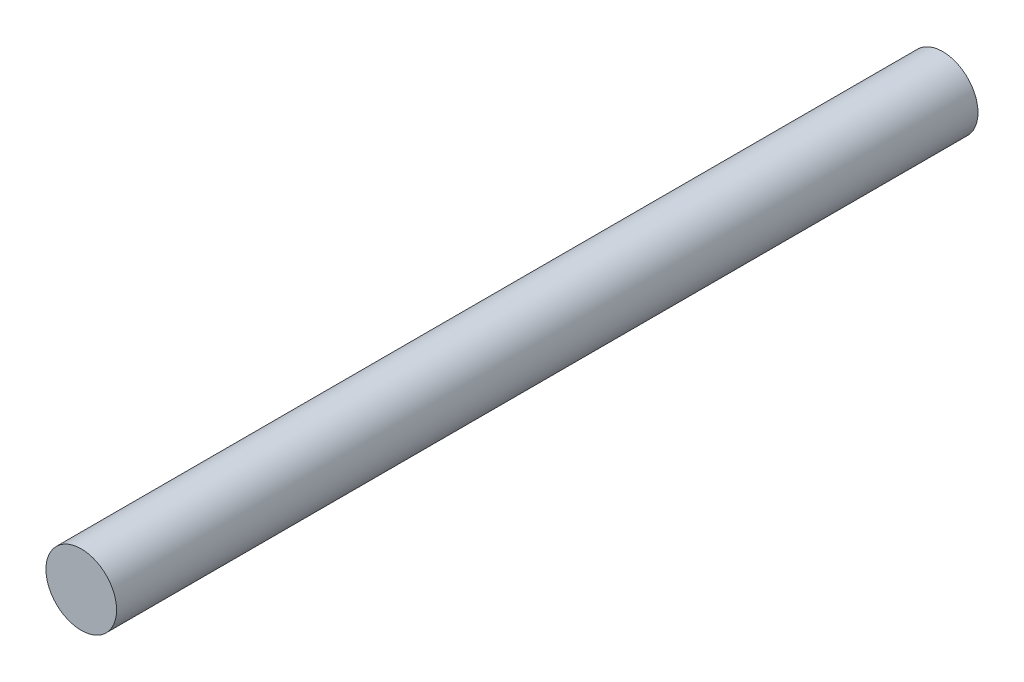
ISO-10303-21;
HEADER;
FILE_DESCRIPTION(('STEP AP214'),'2;1');
FILE_NAME('part.step','',(''),(''),'','','');
FILE_SCHEMA(('AUTOMOTIVE_DESIGN { 1 0 10303 214 1 1 1 1 }'));
ENDSEC;
DATA;
#1=APPLICATION_CONTEXT('core data for automotive mechanical design processes');
#2=APPLICATION_PROTOCOL_DEFINITION('international standard','automotive_design',2000,#1);
#3=PRODUCT_CONTEXT('',#1,'mechanical');
#4=PRODUCT('Part','Part','',(#3));
#5=PRODUCT_RELATED_PRODUCT_CATEGORY('part','',(#4));
#6=PRODUCT_DEFINITION_FORMATION('','',#4);
#7=PRODUCT_DEFINITION_CONTEXT('part definition',#1,'design');
#8=PRODUCT_DEFINITION('design','',#6,#7);
#9=PRODUCT_DEFINITION_SHAPE('','',#8);
#10=(LENGTH_UNIT() NAMED_UNIT(*) SI_UNIT(.MILLI.,.METRE.));
#11=(NAMED_UNIT(*) PLANE_ANGLE_UNIT() SI_UNIT($,.RADIAN.));
#12=(NAMED_UNIT(*) SI_UNIT($,.STERADIAN.) SOLID_ANGLE_UNIT());
#13=UNCERTAINTY_MEASURE_WITH_UNIT(LENGTH_MEASURE(1.E-05),#10,'distance_accuracy_value','');
#14=(GEOMETRIC_REPRESENTATION_CONTEXT(3) GLOBAL_UNCERTAINTY_ASSIGNED_CONTEXT((#13)) GLOBAL_UNIT_ASSIGNED_CONTEXT((#10,
#11,#12)) REPRESENTATION_CONTEXT('',''));
#15=CARTESIAN_POINT('',(0.,0.,0.));
#16=DIRECTION('',(0.,0.,1.));
#17=DIRECTION('',(1.,0.,0.));
#18=AXIS2_PLACEMENT_3D('',#15,#16,#17);
#19=CARTESIAN_POINT('',(0.,0.,304.8));
#20=DIRECTION('',(0.,0.,-1.));
#21=DIRECTION('',(-1.,0.,0.));
#22=AXIS2_PLACEMENT_3D('',#19,#20,#21);
#23=CYLINDRICAL_SURFACE('',#22,25.);
#24=CARTESIAN_POINT('',(0.,0.,304.8));
#25=DIRECTION('',(0.,0.,1.));
#26=DIRECTION('',(1.,0.,0.));
#27=AXIS2_PLACEMENT_3D('',#24,#25,#26);
#28=CIRCLE('',#27,25.);
#29=CARTESIAN_POINT('',(25.,0.,304.8));
#30=VERTEX_POINT('',#29);
#31=EDGE_CURVE('E10',#30,#30,#28,.T.);
#32=ORIENTED_EDGE('',*,*,#31,.F.);
#33=EDGE_LOOP('',(#32));
#34=FACE_BOUND('',#33,.T.);
#35=CARTESIAN_POINT('',(0.,0.,-304.8));
#36=DIRECTION('',(0.,0.,1.));
#37=DIRECTION('',(1.,0.,0.));
#38=AXIS2_PLACEMENT_3D('',#35,#36,#37);
#39=CIRCLE('',#38,25.);
#40=CARTESIAN_POINT('',(25.,0.,-304.8));
#41=VERTEX_POINT('',#40);
#42=EDGE_CURVE('E38',#41,#41,#39,.T.);
#43=ORIENTED_EDGE('',*,*,#42,.T.);
#44=EDGE_LOOP('',(#43));
#45=FACE_BOUND('',#44,.T.);
#46=ADVANCED_FACE('F32',(#34,#45),#23,.T.);
#47=CARTESIAN_POINT('',(0.,0.,304.8));
#48=DIRECTION('',(0.,0.,1.));
#49=DIRECTION('',(1.,0.,0.));
#50=AXIS2_PLACEMENT_3D('',#47,#48,#49);
#51=PLANE('',#50);
#52=ORIENTED_EDGE('',*,*,#31,.T.);
#53=EDGE_LOOP('',(#52));
#54=FACE_BOUND('',#53,.T.);
#55=ADVANCED_FACE('F47',(#54),#51,.T.);
#56=CARTESIAN_POINT('',(0.,0.,-304.8));
#57=DIRECTION('',(0.,0.,1.));
#58=DIRECTION('',(1.,0.,0.));
#59=AXIS2_PLACEMENT_3D('',#56,#57,#58);
#60=PLANE('',#59);
#61=ORIENTED_EDGE('',*,*,#42,.F.);
#62=EDGE_LOOP('',(#61));
#63=FACE_BOUND('',#62,.T.);
#64=ADVANCED_FACE('F45',(#63),#60,.F.);
#65=CLOSED_SHELL('',(#46,#55,#64));
#66=MANIFOLD_SOLID_BREP('B2',#65);
#67=ADVANCED_BREP_SHAPE_REPRESENTATION('',(#18,#66),#14);
#68=SHAPE_DEFINITION_REPRESENTATION(#9,#67);
ENDSEC;
END-ISO-10303-21;
